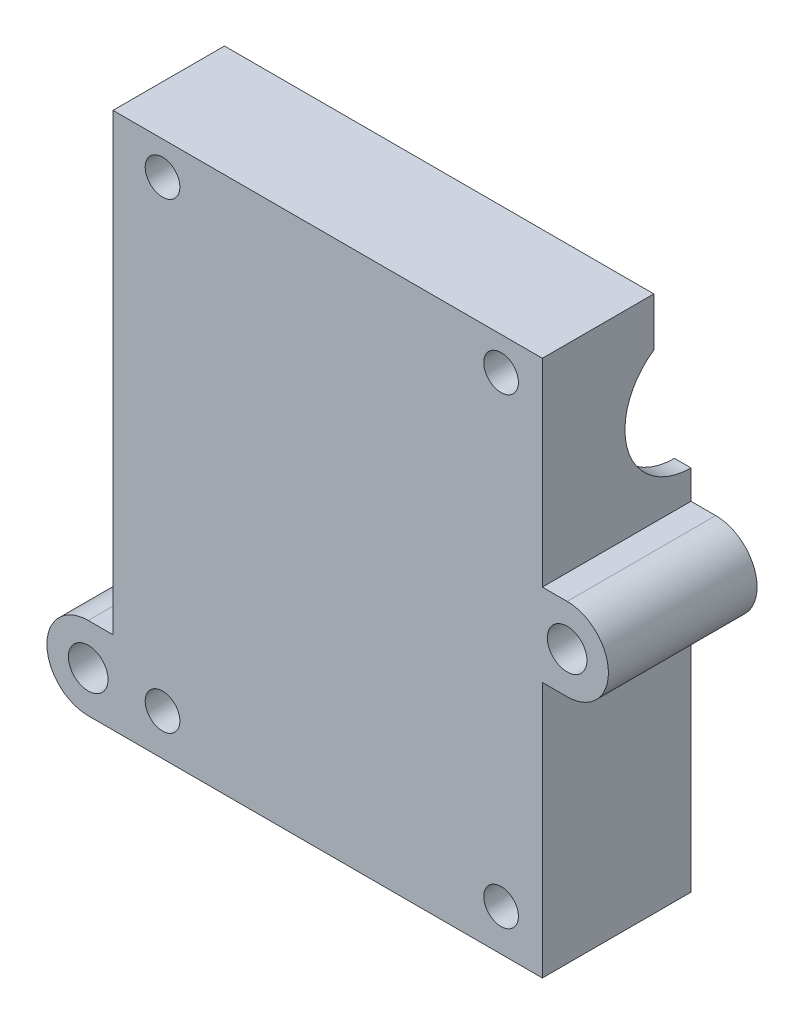
ISO-10303-21;
HEADER;
FILE_DESCRIPTION(('STEP AP214'),'2;1');
FILE_NAME('part.step','',(''),(''),'','','');
FILE_SCHEMA(('AUTOMOTIVE_DESIGN { 1 0 10303 214 1 1 1 1 }'));
ENDSEC;
DATA;
#1=APPLICATION_CONTEXT('core data for automotive mechanical design processes');
#2=APPLICATION_PROTOCOL_DEFINITION('international standard','automotive_design',2000,#1);
#3=PRODUCT_CONTEXT('',#1,'mechanical');
#4=PRODUCT('Part','Part','',(#3));
#5=PRODUCT_RELATED_PRODUCT_CATEGORY('part','',(#4));
#6=PRODUCT_DEFINITION_FORMATION('','',#4);
#7=PRODUCT_DEFINITION_CONTEXT('part definition',#1,'design');
#8=PRODUCT_DEFINITION('design','',#6,#7);
#9=PRODUCT_DEFINITION_SHAPE('','',#8);
#10=(LENGTH_UNIT() NAMED_UNIT(*) SI_UNIT(.MILLI.,.METRE.));
#11=(NAMED_UNIT(*) PLANE_ANGLE_UNIT() SI_UNIT($,.RADIAN.));
#12=(NAMED_UNIT(*) SI_UNIT($,.STERADIAN.) SOLID_ANGLE_UNIT());
#13=UNCERTAINTY_MEASURE_WITH_UNIT(LENGTH_MEASURE(1.E-05),#10,'distance_accuracy_value','');
#14=(GEOMETRIC_REPRESENTATION_CONTEXT(3) GLOBAL_UNCERTAINTY_ASSIGNED_CONTEXT((#13)) GLOBAL_UNIT_ASSIGNED_CONTEXT((#10,
#11,#12)) REPRESENTATION_CONTEXT('',''));
#15=CARTESIAN_POINT('',(0.,0.,0.));
#16=DIRECTION('',(0.,0.,1.));
#17=DIRECTION('',(1.,0.,0.));
#18=AXIS2_PLACEMENT_3D('',#15,#16,#17);
#19=CARTESIAN_POINT('',(0.,0.,-4.28190217244368));
#20=DIRECTION('',(0.,0.,-1.));
#21=DIRECTION('',(-1.,0.,0.));
#22=AXIS2_PLACEMENT_3D('',#19,#20,#21);
#23=PLANE('',#22);
#24=DIRECTION('',(0.,1.,0.));
#25=VECTOR('',#24,1.);
#26=CARTESIAN_POINT('',(12.0219936311464,4.85615145466885,-4.28190217244368));
#27=LINE('',#26,#25);
#28=CARTESIAN_POINT('',(12.0219936311464,-25.1438485453311,-4.28190217244367));
#29=VERTEX_POINT('',#28);
#30=CARTESIAN_POINT('',(12.0219936311464,9.35615145466886,-4.28190217244367));
#31=VERTEX_POINT('',#30);
#32=EDGE_CURVE('E236',#29,#31,#27,.T.);
#33=ORIENTED_EDGE('',*,*,#32,.T.);
#34=DIRECTION('',(-1.,0.,0.));
#35=VECTOR('',#34,1.);
#36=CARTESIAN_POINT('',(64.0219936311464,9.35615145466886,-4.28190217244367));
#37=LINE('',#36,#35);
#38=CARTESIAN_POINT('',(14.9219936311464,9.35615145466886,-4.28190217244367));
#39=VERTEX_POINT('',#38);
#40=EDGE_CURVE('E232',#31,#39,#37,.F.);
#41=ORIENTED_EDGE('',*,*,#40,.T.);
#42=DIRECTION('',(0.,-1.,0.));
#43=VECTOR('',#42,1.);
#44=CARTESIAN_POINT('',(14.9219936311464,35.8561514546689,-4.28190217244368));
#45=LINE('',#44,#43);
#46=CARTESIAN_POINT('',(14.9219936311464,-35.1438485453311,-4.28190217244367));
#47=VERTEX_POINT('',#46);
#48=EDGE_CURVE('E317',#39,#47,#45,.T.);
#49=ORIENTED_EDGE('',*,*,#48,.T.);
#50=DIRECTION('',(1.,0.,0.));
#51=VECTOR('',#50,1.);
#52=CARTESIAN_POINT('',(0.,-35.1438485453311,-4.28190217244368));
#53=LINE('',#52,#51);
#54=CARTESIAN_POINT('',(9.02199363114642,-35.1438485453311,-4.28190217244367));
#55=VERTEX_POINT('',#54);
#56=EDGE_CURVE('E225',#55,#47,#53,.T.);
#57=ORIENTED_EDGE('',*,*,#56,.F.);
#58=CARTESIAN_POINT('',(9.02199363114642,-30.1438485453311,-4.28190217244367));
#59=DIRECTION('',(0.,0.,-1.));
#60=DIRECTION('',(-1.,0.,0.));
#61=AXIS2_PLACEMENT_3D('',#58,#59,#60);
#62=CIRCLE('',#61,5.);
#63=CARTESIAN_POINT('',(9.02199363114642,-25.1438485453311,-4.28190217244367));
#64=VERTEX_POINT('',#63);
#65=EDGE_CURVE('E310',#64,#55,#62,.F.);
#66=ORIENTED_EDGE('',*,*,#65,.F.);
#67=DIRECTION('',(-1.,0.,0.));
#68=VECTOR('',#67,1.);
#69=CARTESIAN_POINT('',(12.0219936311464,-25.1438485453311,-4.28190217244367));
#70=LINE('',#69,#68);
#71=EDGE_CURVE('E308',#29,#64,#70,.T.);
#72=ORIENTED_EDGE('',*,*,#71,.F.);
#73=EDGE_LOOP('',(#33,#41,#49,#57,#66,#72));
#74=FACE_BOUND('',#73,.T.);
#75=CARTESIAN_POINT('',(9.02199363114642,-30.1438485453311,-4.28190217244367));
#76=DIRECTION('',(0.,0.,-1.));
#77=DIRECTION('',(-1.,0.,0.));
#78=AXIS2_PLACEMENT_3D('',#75,#76,#77);
#79=CIRCLE('',#78,2.4);
#80=CARTESIAN_POINT('',(6.62199363114642,-30.1438485453311,-4.28190217244367));
#81=VERTEX_POINT('',#80);
#82=EDGE_CURVE('E233',#81,#81,#79,.F.);
#83=ORIENTED_EDGE('',*,*,#82,.T.);
#84=EDGE_LOOP('',(#83));
#85=FACE_BOUND('',#84,.T.);
#86=ADVANCED_FACE('F33',(#74,#85),#23,.T.);
#87=CARTESIAN_POINT('',(67.0219936311464,0.856151454668876,-4.28190217244367));
#88=DIRECTION('',(0.,0.,-1.));
#89=DIRECTION('',(-1.,0.,0.));
#90=AXIS2_PLACEMENT_3D('',#87,#88,#89);
#91=CIRCLE('',#90,2.4);
#92=CARTESIAN_POINT('',(64.6219936311464,0.856151454668876,-4.28190217244367));
#93=VERTEX_POINT('',#92);
#94=EDGE_CURVE('E239',#93,#93,#91,.F.);
#95=ORIENTED_EDGE('',*,*,#94,.T.);
#96=EDGE_LOOP('',(#95));
#97=FACE_BOUND('',#96,.T.);
#98=CARTESIAN_POINT('',(62.0219936311464,-35.1438485453311,-4.28190217244368));
#99=VERTEX_POINT('',#98);
#100=CARTESIAN_POINT('',(64.0219936311464,-35.1438485453311,-4.28190217244367));
#101=VERTEX_POINT('',#100);
#102=EDGE_CURVE('E312',#99,#101,#53,.T.);
#103=ORIENTED_EDGE('',*,*,#102,.F.);
#104=DIRECTION('',(0.,1.,0.));
#105=VECTOR('',#104,1.);
#106=CARTESIAN_POINT('',(62.0219936311464,35.8561514546689,-4.28190217244367));
#107=LINE('',#106,#105);
#108=CARTESIAN_POINT('',(62.0219936311464,9.35615145466886,-4.28190217244367));
#109=VERTEX_POINT('',#108);
#110=EDGE_CURVE('E231',#99,#109,#107,.T.);
#111=ORIENTED_EDGE('',*,*,#110,.T.);
#112=DIRECTION('',(-1.,0.,0.));
#113=VECTOR('',#112,1.);
#114=CARTESIAN_POINT('',(64.0219936311464,9.35615145466886,-4.28190217244367));
#115=LINE('',#114,#113);
#116=CARTESIAN_POINT('',(64.0219936311464,9.35615145466886,-4.28190217244367));
#117=VERTEX_POINT('',#116);
#118=EDGE_CURVE('E212',#109,#117,#115,.F.);
#119=ORIENTED_EDGE('',*,*,#118,.T.);
#120=DIRECTION('',(0.,1.,0.));
#121=VECTOR('',#120,1.);
#122=CARTESIAN_POINT('',(64.0219936311464,29.8561514546689,-4.28190217244367));
#123=LINE('',#122,#121);
#124=CARTESIAN_POINT('',(64.0219936311464,5.85615145466888,-4.28190217244367));
#125=VERTEX_POINT('',#124);
#126=EDGE_CURVE('E221',#125,#117,#123,.T.);
#127=ORIENTED_EDGE('',*,*,#126,.F.);
#128=DIRECTION('',(-1.,0.,0.));
#129=VECTOR('',#128,1.);
#130=CARTESIAN_POINT('',(64.0219936311464,5.85615145466888,-4.28190217244367));
#131=LINE('',#130,#129);
#132=CARTESIAN_POINT('',(67.0219936311464,5.85615145466888,-4.28190217244367));
#133=VERTEX_POINT('',#132);
#134=EDGE_CURVE('E302',#133,#125,#131,.T.);
#135=ORIENTED_EDGE('',*,*,#134,.F.);
#136=CARTESIAN_POINT('',(67.0219936311464,0.856151454668876,-4.28190217244367));
#137=DIRECTION('',(0.,0.,-1.));
#138=DIRECTION('',(-1.,0.,0.));
#139=AXIS2_PLACEMENT_3D('',#136,#137,#138);
#140=CIRCLE('',#139,5.);
#141=CARTESIAN_POINT('',(67.0219936311464,-4.14384854533112,-4.28190217244367));
#142=VERTEX_POINT('',#141);
#143=EDGE_CURVE('E306',#142,#133,#140,.F.);
#144=ORIENTED_EDGE('',*,*,#143,.F.);
#145=DIRECTION('',(1.,0.,0.));
#146=VECTOR('',#145,1.);
#147=CARTESIAN_POINT('',(64.0219936311464,-4.14384854533112,-4.28190217244367));
#148=LINE('',#147,#146);
#149=CARTESIAN_POINT('',(64.0219936311464,-4.14384854533112,-4.28190217244367));
#150=VERTEX_POINT('',#149);
#151=EDGE_CURVE('E286',#150,#142,#148,.T.);
#152=ORIENTED_EDGE('',*,*,#151,.F.);
#153=DIRECTION('',(0.,1.,0.));
#154=VECTOR('',#153,1.);
#155=CARTESIAN_POINT('',(64.0219936311464,29.8561514546689,-4.28190217244367));
#156=LINE('',#155,#154);
#157=EDGE_CURVE('E226',#101,#150,#156,.T.);
#158=ORIENTED_EDGE('',*,*,#157,.F.);
#159=EDGE_LOOP('',(#103,#111,#119,#127,#135,#144,#152,#158));
#160=FACE_BOUND('',#159,.T.);
#161=ADVANCED_FACE('F229',(#97,#160),#23,.T.);
#162=CARTESIAN_POINT('',(64.0219936311464,29.8561514546689,-17.2819021724437));
#163=DIRECTION('',(1.,0.,0.));
#164=DIRECTION('',(0.,0.,-1.));
#165=AXIS2_PLACEMENT_3D('',#162,#163,#164);
#166=PLANE('',#165);
#167=DIRECTION('',(0.,0.,1.));
#168=VECTOR('',#167,1.);
#169=CARTESIAN_POINT('',(64.0219936311464,-35.1438485453311,-22.2819021724437));
#170=LINE('',#169,#168);
#171=CARTESIAN_POINT('',(64.0219936311464,-35.1438485453311,13.7180978275563));
#172=VERTEX_POINT('',#171);
#173=EDGE_CURVE('E259',#101,#172,#170,.T.);
#174=ORIENTED_EDGE('',*,*,#173,.F.);
#175=ORIENTED_EDGE('',*,*,#157,.T.);
#176=DIRECTION('',(0.,0.,1.));
#177=VECTOR('',#176,1.);
#178=CARTESIAN_POINT('',(64.0219936311464,-4.14384854533112,-40.0881506473094));
#179=LINE('',#178,#177);
#180=CARTESIAN_POINT('',(64.0219936311464,-4.14384854533112,13.7180978275563));
#181=VERTEX_POINT('',#180);
#182=EDGE_CURVE('E277',#150,#181,#179,.T.);
#183=ORIENTED_EDGE('',*,*,#182,.T.);
#184=DIRECTION('',(0.,1.,0.));
#185=VECTOR('',#184,1.);
#186=CARTESIAN_POINT('',(64.0219936311464,4.85615145466886,13.7180978275563));
#187=LINE('',#186,#185);
#188=EDGE_CURVE('E298',#172,#181,#187,.T.);
#189=ORIENTED_EDGE('',*,*,#188,.F.);
#190=EDGE_LOOP('',(#174,#175,#183,#189));
#191=FACE_BOUND('',#190,.T.);
#192=ADVANCED_FACE('F378',(#191),#166,.T.);
#193=CARTESIAN_POINT('',(62.0219936311464,35.8561514546689,-14.7819021724437));
#194=DIRECTION('',(1.,0.,0.));
#195=DIRECTION('',(0.,1.,0.));
#196=AXIS2_PLACEMENT_3D('',#193,#194,#195);
#197=PLANE('',#196);
#198=ORIENTED_EDGE('',*,*,#110,.F.);
#199=DIRECTION('',(0.,0.,1.));
#200=VECTOR('',#199,1.);
#201=CARTESIAN_POINT('',(62.0219936311464,-35.1438485453311,-14.7819021724437));
#202=LINE('',#201,#200);
#203=CARTESIAN_POINT('',(62.0219936311464,-35.1438485453311,6.21809782755633));
#204=VERTEX_POINT('',#203);
#205=EDGE_CURVE('E263',#99,#204,#202,.T.);
#206=ORIENTED_EDGE('',*,*,#205,.T.);
#207=DIRECTION('',(0.,-1.,0.));
#208=VECTOR('',#207,1.);
#209=CARTESIAN_POINT('',(62.0219936311464,35.8561514546689,6.21809782755633));
#210=LINE('',#209,#208);
#211=CARTESIAN_POINT('',(62.0219936311464,15.9848707168199,6.21809782755633));
#212=VERTEX_POINT('',#211);
#213=EDGE_CURVE('E431',#212,#204,#210,.T.);
#214=ORIENTED_EDGE('',*,*,#213,.F.);
#215=CARTESIAN_POINT('',(62.0219936311464,12.7061514546689,-4.28190217244367));
#216=DIRECTION('',(1.,0.,0.));
#217=DIRECTION('',(0.,1.,0.));
#218=AXIS2_PLACEMENT_3D('',#215,#216,#217);
#219=CIRCLE('',#218,11.);
#220=CARTESIAN_POINT('',(62.0219936311464,21.1601837127334,2.75580616050141));
#221=VERTEX_POINT('',#220);
#222=EDGE_CURVE('E462',#212,#221,#219,.F.);
#223=ORIENTED_EDGE('',*,*,#222,.T.);
#224=CARTESIAN_POINT('',(62.0219936311464,17.3561514546689,-4.28190217244367));
#225=DIRECTION('',(1.,0.,0.));
#226=DIRECTION('',(0.,1.,0.));
#227=AXIS2_PLACEMENT_3D('',#224,#225,#226);
#228=CIRCLE('',#227,8.);
#229=EDGE_CURVE('E252',#221,#109,#228,.T.);
#230=ORIENTED_EDGE('',*,*,#229,.T.);
#231=EDGE_LOOP('',(#198,#206,#214,#223,#230));
#232=FACE_BOUND('',#231,.T.);
#233=ADVANCED_FACE('F380',(#232),#197,.F.);
#234=CARTESIAN_POINT('',(14.9219936311464,35.8561514546689,-12.7819021724437));
#235=DIRECTION('',(-1.,0.,0.));
#236=DIRECTION('',(0.,-1.,0.));
#237=AXIS2_PLACEMENT_3D('',#234,#235,#236);
#238=PLANE('',#237);
#239=ORIENTED_EDGE('',*,*,#48,.F.);
#240=CARTESIAN_POINT('',(14.9219936311464,17.3561514546689,-4.28190217244367));
#241=DIRECTION('',(-1.,0.,0.));
#242=DIRECTION('',(0.,-1.,0.));
#243=AXIS2_PLACEMENT_3D('',#240,#241,#242);
#244=CIRCLE('',#243,8.);
#245=CARTESIAN_POINT('',(14.9219936311464,21.1601837127334,2.7558061605014));
#246=VERTEX_POINT('',#245);
#247=EDGE_CURVE('E254',#39,#246,#244,.T.);
#248=ORIENTED_EDGE('',*,*,#247,.T.);
#249=CARTESIAN_POINT('',(14.9219936311464,12.7061514546689,-4.28190217244368));
#250=DIRECTION('',(-1.,0.,0.));
#251=DIRECTION('',(0.,1.,0.));
#252=AXIS2_PLACEMENT_3D('',#249,#250,#251);
#253=CIRCLE('',#252,11.);
#254=CARTESIAN_POINT('',(14.9219936311464,19.6882714765533,4.21809782755633));
#255=VERTEX_POINT('',#254);
#256=EDGE_CURVE('E460',#255,#246,#253,.T.);
#257=ORIENTED_EDGE('',*,*,#256,.F.);
#258=DIRECTION('',(0.,-1.,0.));
#259=VECTOR('',#258,1.);
#260=CARTESIAN_POINT('',(14.9219936311464,35.8561514546689,4.21809782755633));
#261=LINE('',#260,#259);
#262=CARTESIAN_POINT('',(14.9219936311464,-35.1438485453311,4.21809782755633));
#263=VERTEX_POINT('',#262);
#264=EDGE_CURVE('E436',#255,#263,#261,.T.);
#265=ORIENTED_EDGE('',*,*,#264,.T.);
#266=DIRECTION('',(0.,0.,-1.));
#267=VECTOR('',#266,1.);
#268=CARTESIAN_POINT('',(14.9219936311464,-35.1438485453311,4.21809782755633));
#269=LINE('',#268,#267);
#270=EDGE_CURVE('E265',#263,#47,#269,.T.);
#271=ORIENTED_EDGE('',*,*,#270,.T.);
#272=EDGE_LOOP('',(#239,#248,#257,#265,#271));
#273=FACE_BOUND('',#272,.T.);
#274=ADVANCED_FACE('F332',(#273),#238,.F.);
#275=DIRECTION('',(0.,0.,1.));
#276=VECTOR('',#275,1.);
#277=CARTESIAN_POINT('',(64.0219936311464,5.85615145466888,-40.0881506473094));
#278=LINE('',#277,#276);
#279=CARTESIAN_POINT('',(64.0219936311464,5.85615145466888,13.7180978275563));
#280=VERTEX_POINT('',#279);
#281=EDGE_CURVE('E59',#125,#280,#278,.T.);
#282=ORIENTED_EDGE('',*,*,#281,.F.);
#283=ORIENTED_EDGE('',*,*,#126,.T.);
#284=CARTESIAN_POINT('',(64.0219936311464,17.3561514546689,-4.28190217244367));
#285=DIRECTION('',(-1.,0.,0.));
#286=DIRECTION('',(0.,0.,1.));
#287=AXIS2_PLACEMENT_3D('',#284,#285,#286);
#288=CIRCLE('',#287,8.);
#289=CARTESIAN_POINT('',(64.0219936311464,23.9705297323303,0.218097827556323));
#290=VERTEX_POINT('',#289);
#291=EDGE_CURVE('E207',#117,#290,#288,.T.);
#292=ORIENTED_EDGE('',*,*,#291,.T.);
#293=DIRECTION('',(0.,1.,0.));
#294=VECTOR('',#293,1.);
#295=CARTESIAN_POINT('',(64.0219936311464,22.8561514546689,0.218097827556323));
#296=LINE('',#295,#294);
#297=CARTESIAN_POINT('',(64.0219936311464,29.8561514546689,0.218097827556323));
#298=VERTEX_POINT('',#297);
#299=EDGE_CURVE('E481',#290,#298,#296,.T.);
#300=ORIENTED_EDGE('',*,*,#299,.T.);
#301=DIRECTION('',(0.,0.,-1.));
#302=VECTOR('',#301,1.);
#303=CARTESIAN_POINT('',(64.0219936311464,29.8561514546689,-17.2819021724437));
#304=LINE('',#303,#302);
#305=CARTESIAN_POINT('',(64.0219936311464,29.8561514546689,13.7180978275563));
#306=VERTEX_POINT('',#305);
#307=EDGE_CURVE('E245',#306,#298,#304,.T.);
#308=ORIENTED_EDGE('',*,*,#307,.F.);
#309=EDGE_CURVE('E430',#280,#306,#187,.T.);
#310=ORIENTED_EDGE('',*,*,#309,.F.);
#311=EDGE_LOOP('',(#282,#283,#292,#300,#308,#310));
#312=FACE_BOUND('',#311,.T.);
#313=ADVANCED_FACE('F222',(#312),#166,.T.);
#314=CARTESIAN_POINT('',(12.0219936311464,4.85615145466885,13.7180978275563));
#315=DIRECTION('',(1.,0.,0.));
#316=DIRECTION('',(0.,0.,-1.));
#317=AXIS2_PLACEMENT_3D('',#314,#315,#316);
#318=PLANE('',#317);
#319=ORIENTED_EDGE('',*,*,#32,.F.);
#320=DIRECTION('',(0.,0.,1.));
#321=VECTOR('',#320,1.);
#322=CARTESIAN_POINT('',(12.0219936311464,-25.1438485453311,-40.0881506473094));
#323=LINE('',#322,#321);
#324=CARTESIAN_POINT('',(12.0219936311464,-25.1438485453311,13.7180978275563));
#325=VERTEX_POINT('',#324);
#326=EDGE_CURVE('E79',#29,#325,#323,.T.);
#327=ORIENTED_EDGE('',*,*,#326,.T.);
#328=DIRECTION('',(0.,-1.,0.));
#329=VECTOR('',#328,1.);
#330=CARTESIAN_POINT('',(12.0219936311464,4.85615145466885,13.7180978275563));
#331=LINE('',#330,#329);
#332=CARTESIAN_POINT('',(12.0219936311464,29.8561514546689,13.7180978275563));
#333=VERTEX_POINT('',#332);
#334=EDGE_CURVE('E251',#333,#325,#331,.T.);
#335=ORIENTED_EDGE('',*,*,#334,.F.);
#336=DIRECTION('',(0.,0.,-1.));
#337=VECTOR('',#336,1.);
#338=CARTESIAN_POINT('',(12.0219936311464,29.8561514546689,13.7180978275563));
#339=LINE('',#338,#337);
#340=CARTESIAN_POINT('',(12.0219936311464,29.8561514546689,0.218097827556329));
#341=VERTEX_POINT('',#340);
#342=EDGE_CURVE('E247',#333,#341,#339,.T.);
#343=ORIENTED_EDGE('',*,*,#342,.T.);
#344=DIRECTION('',(0.,1.,0.));
#345=VECTOR('',#344,1.);
#346=CARTESIAN_POINT('',(12.0219936311464,22.8561514546689,0.218097827556329));
#347=LINE('',#346,#345);
#348=CARTESIAN_POINT('',(12.0219936311464,23.9705297323303,0.218097827556329));
#349=VERTEX_POINT('',#348);
#350=EDGE_CURVE('E482',#349,#341,#347,.T.);
#351=ORIENTED_EDGE('',*,*,#350,.F.);
#352=CARTESIAN_POINT('',(12.0219936311464,17.3561514546689,-4.28190217244367));
#353=DIRECTION('',(-1.,0.,0.));
#354=DIRECTION('',(0.,0.,1.));
#355=AXIS2_PLACEMENT_3D('',#352,#353,#354);
#356=CIRCLE('',#355,8.);
#357=EDGE_CURVE('E217',#31,#349,#356,.T.);
#358=ORIENTED_EDGE('',*,*,#357,.F.);
#359=EDGE_LOOP('',(#319,#327,#335,#343,#351,#358));
#360=FACE_BOUND('',#359,.T.);
#361=ADVANCED_FACE('F396',(#360),#318,.F.);
#362=CARTESIAN_POINT('',(64.0219936311464,17.3561514546689,-4.28190217244367));
#363=DIRECTION('',(-1.,0.,0.));
#364=DIRECTION('',(0.,0.,1.));
#365=AXIS2_PLACEMENT_3D('',#362,#363,#364);
#366=CYLINDRICAL_SURFACE('',#365,8.);
#367=ORIENTED_EDGE('',*,*,#40,.F.);
#368=ORIENTED_EDGE('',*,*,#357,.T.);
#369=DIRECTION('',(-1.,0.,0.));
#370=VECTOR('',#369,1.);
#371=CARTESIAN_POINT('',(64.0219936311464,23.9705297323303,0.218097827556323));
#372=LINE('',#371,#370);
#373=CARTESIAN_POINT('',(14.9219936311464,23.9705297323303,0.218097827556323));
#374=VERTEX_POINT('',#373);
#375=EDGE_CURVE('E478',#349,#374,#372,.F.);
#376=ORIENTED_EDGE('',*,*,#375,.T.);
#377=EDGE_CURVE('E218',#246,#374,#244,.T.);
#378=ORIENTED_EDGE('',*,*,#377,.F.);
#379=ORIENTED_EDGE('',*,*,#247,.F.);
#380=EDGE_LOOP('',(#367,#368,#376,#378,#379));
#381=FACE_BOUND('',#380,.T.);
#382=ADVANCED_FACE('F35',(#381),#366,.F.);
#383=ORIENTED_EDGE('',*,*,#118,.F.);
#384=ORIENTED_EDGE('',*,*,#229,.F.);
#385=CARTESIAN_POINT('',(62.0219936311464,23.9705297323303,0.218097827556323));
#386=VERTEX_POINT('',#385);
#387=EDGE_CURVE('E255',#386,#221,#228,.T.);
#388=ORIENTED_EDGE('',*,*,#387,.F.);
#389=DIRECTION('',(-1.,0.,0.));
#390=VECTOR('',#389,1.);
#391=CARTESIAN_POINT('',(64.0219936311464,23.9705297323303,0.218097827556323));
#392=LINE('',#391,#390);
#393=EDGE_CURVE('E215',#386,#290,#392,.F.);
#394=ORIENTED_EDGE('',*,*,#393,.T.);
#395=ORIENTED_EDGE('',*,*,#291,.F.);
#396=EDGE_LOOP('',(#383,#384,#388,#394,#395));
#397=FACE_BOUND('',#396,.T.);
#398=ADVANCED_FACE('F209',(#397),#366,.F.);
#399=CARTESIAN_POINT('',(0.,-35.1438485453311,0.));
#400=DIRECTION('',(0.,-1.,0.));
#401=DIRECTION('',(1.,0.,0.));
#402=AXIS2_PLACEMENT_3D('',#399,#400,#401);
#403=PLANE('',#402);
#404=DIRECTION('',(0.,0.,1.));
#405=VECTOR('',#404,1.);
#406=CARTESIAN_POINT('',(9.02199363114642,-35.1438485453311,-40.0881506473094));
#407=LINE('',#406,#405);
#408=CARTESIAN_POINT('',(9.02199363114642,-35.1438485453311,13.7180978275563));
#409=VERTEX_POINT('',#408);
#410=EDGE_CURVE('E67',#55,#409,#407,.T.);
#411=ORIENTED_EDGE('',*,*,#410,.F.);
#412=ORIENTED_EDGE('',*,*,#56,.T.);
#413=ORIENTED_EDGE('',*,*,#270,.F.);
#414=DIRECTION('',(-1.,0.,0.));
#415=VECTOR('',#414,1.);
#416=CARTESIAN_POINT('',(23.9219936311464,-35.1438485453311,4.21809782755633));
#417=LINE('',#416,#415);
#418=CARTESIAN_POINT('',(23.9219936311464,-35.1438485453311,4.21809782755633));
#419=VERTEX_POINT('',#418);
#420=EDGE_CURVE('E269',#419,#263,#417,.T.);
#421=ORIENTED_EDGE('',*,*,#420,.F.);
#422=DIRECTION('',(0.,0.,-1.));
#423=VECTOR('',#422,1.);
#424=CARTESIAN_POINT('',(23.9219936311464,-35.1438485453311,6.71809782755633));
#425=LINE('',#424,#423);
#426=CARTESIAN_POINT('',(23.9219936311464,-35.1438485453311,6.71809782755633));
#427=VERTEX_POINT('',#426);
#428=EDGE_CURVE('E261',#427,#419,#425,.T.);
#429=ORIENTED_EDGE('',*,*,#428,.F.);
#430=DIRECTION('',(-1.,0.,0.));
#431=VECTOR('',#430,1.);
#432=CARTESIAN_POINT('',(51.9219936311464,-35.1438485453311,6.71809782755633));
#433=LINE('',#432,#431);
#434=CARTESIAN_POINT('',(51.9219936311464,-35.1438485453311,6.71809782755633));
#435=VERTEX_POINT('',#434);
#436=EDGE_CURVE('E468',#435,#427,#433,.T.);
#437=ORIENTED_EDGE('',*,*,#436,.F.);
#438=DIRECTION('',(0.,0.,1.));
#439=VECTOR('',#438,1.);
#440=CARTESIAN_POINT('',(51.9219936311464,-35.1438485453311,6.21809782755632));
#441=LINE('',#440,#439);
#442=CARTESIAN_POINT('',(51.9219936311464,-35.1438485453311,6.21809782755632));
#443=VERTEX_POINT('',#442);
#444=EDGE_CURVE('E471',#443,#435,#441,.T.);
#445=ORIENTED_EDGE('',*,*,#444,.F.);
#446=DIRECTION('',(-1.,0.,0.));
#447=VECTOR('',#446,1.);
#448=CARTESIAN_POINT('',(62.0219936311464,-35.1438485453311,6.21809782755633));
#449=LINE('',#448,#447);
#450=EDGE_CURVE('E266',#204,#443,#449,.T.);
#451=ORIENTED_EDGE('',*,*,#450,.F.);
#452=ORIENTED_EDGE('',*,*,#205,.F.);
#453=ORIENTED_EDGE('',*,*,#102,.T.);
#454=ORIENTED_EDGE('',*,*,#173,.T.);
#455=DIRECTION('',(-1.,0.,0.));
#456=VECTOR('',#455,1.);
#457=CARTESIAN_POINT('',(64.0219936311464,-35.1438485453311,13.7180978275563));
#458=LINE('',#457,#456);
#459=EDGE_CURVE('E262',#172,#409,#458,.T.);
#460=ORIENTED_EDGE('',*,*,#459,.T.);
#461=EDGE_LOOP('',(#411,#412,#413,#421,#429,#437,#445,#451,#452,#453,#454,#460));
#462=FACE_BOUND('',#461,.T.);
#463=ADVANCED_FACE('F337',(#462),#403,.T.);
#464=CARTESIAN_POINT('',(9.02199363114642,-30.1438485453311,-40.0881506473094));
#465=DIRECTION('',(0.,0.,1.));
#466=DIRECTION('',(1.,0.,0.));
#467=AXIS2_PLACEMENT_3D('',#464,#465,#466);
#468=CYLINDRICAL_SURFACE('',#467,5.);
#469=DIRECTION('',(0.,0.,1.));
#470=VECTOR('',#469,1.);
#471=CARTESIAN_POINT('',(9.02199363114642,-25.1438485453311,-40.0881506473094));
#472=LINE('',#471,#470);
#473=CARTESIAN_POINT('',(9.02199363114642,-25.1438485453311,13.7180978275563));
#474=VERTEX_POINT('',#473);
#475=EDGE_CURVE('E271',#64,#474,#472,.T.);
#476=ORIENTED_EDGE('',*,*,#475,.F.);
#477=ORIENTED_EDGE('',*,*,#65,.T.);
#478=ORIENTED_EDGE('',*,*,#410,.T.);
#479=CARTESIAN_POINT('',(9.02199363114642,-30.1438485453311,13.7180978275563));
#480=DIRECTION('',(0.,0.,1.));
#481=DIRECTION('',(1.,0.,0.));
#482=AXIS2_PLACEMENT_3D('',#479,#480,#481);
#483=CIRCLE('',#482,5.);
#484=EDGE_CURVE('E343',#474,#409,#483,.T.);
#485=ORIENTED_EDGE('',*,*,#484,.F.);
#486=EDGE_LOOP('',(#476,#477,#478,#485));
#487=FACE_BOUND('',#486,.T.);
#488=ADVANCED_FACE('F414',(#487),#468,.T.);
#489=CARTESIAN_POINT('',(12.0219936311464,-25.1438485453311,-40.0881506473094));
#490=DIRECTION('',(0.,1.,0.));
#491=DIRECTION('',(0.,0.,1.));
#492=AXIS2_PLACEMENT_3D('',#489,#490,#491);
#493=PLANE('',#492);
#494=ORIENTED_EDGE('',*,*,#326,.F.);
#495=ORIENTED_EDGE('',*,*,#71,.T.);
#496=ORIENTED_EDGE('',*,*,#475,.T.);
#497=DIRECTION('',(-1.,0.,0.));
#498=VECTOR('',#497,1.);
#499=CARTESIAN_POINT('',(12.0219936311464,-25.1438485453311,13.7180978275563));
#500=LINE('',#499,#498);
#501=EDGE_CURVE('E345',#325,#474,#500,.T.);
#502=ORIENTED_EDGE('',*,*,#501,.F.);
#503=EDGE_LOOP('',(#494,#495,#496,#502));
#504=FACE_BOUND('',#503,.T.);
#505=ADVANCED_FACE('F416',(#504),#493,.T.);
#506=CARTESIAN_POINT('',(9.02199363114642,-30.1438485453311,-40.0881506473094));
#507=DIRECTION('',(0.,0.,1.));
#508=DIRECTION('',(1.,0.,0.));
#509=AXIS2_PLACEMENT_3D('',#506,#507,#508);
#510=CYLINDRICAL_SURFACE('',#509,2.4);
#511=CARTESIAN_POINT('',(9.02199363114642,-30.1438485453311,13.7180978275563));
#512=DIRECTION('',(0.,0.,1.));
#513=DIRECTION('',(1.,0.,0.));
#514=AXIS2_PLACEMENT_3D('',#511,#512,#513);
#515=CIRCLE('',#514,2.4);
#516=CARTESIAN_POINT('',(11.4219936311464,-30.1438485453311,13.7180978275563));
#517=VERTEX_POINT('',#516);
#518=EDGE_CURVE('E272',#517,#517,#515,.T.);
#519=ORIENTED_EDGE('',*,*,#518,.T.);
#520=EDGE_LOOP('',(#519));
#521=FACE_BOUND('',#520,.T.);
#522=ORIENTED_EDGE('',*,*,#82,.F.);
#523=EDGE_LOOP('',(#522));
#524=FACE_BOUND('',#523,.T.);
#525=ADVANCED_FACE('F420',(#521,#524),#510,.F.);
#526=CARTESIAN_POINT('',(67.0219936311464,0.856151454668876,-40.0881506473094));
#527=DIRECTION('',(0.,0.,1.));
#528=DIRECTION('',(1.,0.,0.));
#529=AXIS2_PLACEMENT_3D('',#526,#527,#528);
#530=CYLINDRICAL_SURFACE('',#529,5.);
#531=DIRECTION('',(0.,0.,1.));
#532=VECTOR('',#531,1.);
#533=CARTESIAN_POINT('',(67.0219936311464,-4.14384854533112,-40.0881506473094));
#534=LINE('',#533,#532);
#535=CARTESIAN_POINT('',(67.0219936311464,-4.14384854533112,13.7180978275563));
#536=VERTEX_POINT('',#535);
#537=EDGE_CURVE('E42',#142,#536,#534,.T.);
#538=ORIENTED_EDGE('',*,*,#537,.F.);
#539=ORIENTED_EDGE('',*,*,#143,.T.);
#540=DIRECTION('',(0.,0.,1.));
#541=VECTOR('',#540,1.);
#542=CARTESIAN_POINT('',(67.0219936311464,5.85615145466888,-40.0881506473094));
#543=LINE('',#542,#541);
#544=CARTESIAN_POINT('',(67.0219936311464,5.85615145466888,13.7180978275563));
#545=VERTEX_POINT('',#544);
#546=EDGE_CURVE('E11',#133,#545,#543,.T.);
#547=ORIENTED_EDGE('',*,*,#546,.T.);
#548=CARTESIAN_POINT('',(67.0219936311464,0.856151454668876,13.7180978275563));
#549=DIRECTION('',(0.,0.,1.));
#550=DIRECTION('',(1.,0.,0.));
#551=AXIS2_PLACEMENT_3D('',#548,#549,#550);
#552=CIRCLE('',#551,5.);
#553=EDGE_CURVE('E289',#536,#545,#552,.T.);
#554=ORIENTED_EDGE('',*,*,#553,.F.);
#555=EDGE_LOOP('',(#538,#539,#547,#554));
#556=FACE_BOUND('',#555,.T.);
#557=ADVANCED_FACE('F290',(#556),#530,.T.);
#558=CARTESIAN_POINT('',(64.0219936311464,-4.14384854533112,-40.0881506473094));
#559=DIRECTION('',(0.,-1.,0.));
#560=DIRECTION('',(0.,0.,-1.));
#561=AXIS2_PLACEMENT_3D('',#558,#559,#560);
#562=PLANE('',#561);
#563=ORIENTED_EDGE('',*,*,#182,.F.);
#564=ORIENTED_EDGE('',*,*,#151,.T.);
#565=ORIENTED_EDGE('',*,*,#537,.T.);
#566=DIRECTION('',(1.,0.,0.));
#567=VECTOR('',#566,1.);
#568=CARTESIAN_POINT('',(64.0219936311464,-4.14384854533112,13.7180978275563));
#569=LINE('',#568,#567);
#570=EDGE_CURVE('E275',#181,#536,#569,.T.);
#571=ORIENTED_EDGE('',*,*,#570,.F.);
#572=EDGE_LOOP('',(#563,#564,#565,#571));
#573=FACE_BOUND('',#572,.T.);
#574=ADVANCED_FACE('F283',(#573),#562,.T.);
#575=CARTESIAN_POINT('',(64.0219936311464,5.85615145466888,-40.0881506473094));
#576=DIRECTION('',(0.,1.,0.));
#577=DIRECTION('',(0.,0.,1.));
#578=AXIS2_PLACEMENT_3D('',#575,#576,#577);
#579=PLANE('',#578);
#580=ORIENTED_EDGE('',*,*,#546,.F.);
#581=ORIENTED_EDGE('',*,*,#134,.T.);
#582=ORIENTED_EDGE('',*,*,#281,.T.);
#583=DIRECTION('',(-1.,0.,0.));
#584=VECTOR('',#583,1.);
#585=CARTESIAN_POINT('',(64.0219936311464,5.85615145466888,13.7180978275563));
#586=LINE('',#585,#584);
#587=EDGE_CURVE('E292',#545,#280,#586,.T.);
#588=ORIENTED_EDGE('',*,*,#587,.F.);
#589=EDGE_LOOP('',(#580,#581,#582,#588));
#590=FACE_BOUND('',#589,.T.);
#591=ADVANCED_FACE('F576',(#590),#579,.T.);
#592=CARTESIAN_POINT('',(67.0219936311464,0.856151454668876,-40.0881506473094));
#593=DIRECTION('',(0.,0.,1.));
#594=DIRECTION('',(1.,0.,0.));
#595=AXIS2_PLACEMENT_3D('',#592,#593,#594);
#596=CYLINDRICAL_SURFACE('',#595,2.4);
#597=CARTESIAN_POINT('',(67.0219936311464,0.856151454668876,13.7180978275563));
#598=DIRECTION('',(0.,0.,1.));
#599=DIRECTION('',(1.,0.,0.));
#600=AXIS2_PLACEMENT_3D('',#597,#598,#599);
#601=CIRCLE('',#600,2.4);
#602=CARTESIAN_POINT('',(69.4219936311464,0.856151454668876,13.7180978275563));
#603=VERTEX_POINT('',#602);
#604=EDGE_CURVE('E278',#603,#603,#601,.T.);
#605=ORIENTED_EDGE('',*,*,#604,.T.);
#606=EDGE_LOOP('',(#605));
#607=FACE_BOUND('',#606,.T.);
#608=ORIENTED_EDGE('',*,*,#94,.F.);
#609=EDGE_LOOP('',(#608));
#610=FACE_BOUND('',#609,.T.);
#611=ADVANCED_FACE('F356',(#607,#610),#596,.F.);
#612=CARTESIAN_POINT('',(0.521993631146425,29.8561514546689,-17.2819021724437));
#613=DIRECTION('',(0.,1.,0.));
#614=DIRECTION('',(-1.,0.,0.));
#615=AXIS2_PLACEMENT_3D('',#612,#613,#614);
#616=PLANE('',#615);
#617=DIRECTION('',(-1.,0.,0.));
#618=VECTOR('',#617,1.);
#619=CARTESIAN_POINT('',(80.3624543669077,29.8561514546689,0.218097827556328));
#620=LINE('',#619,#618);
#621=EDGE_CURVE('E87',#298,#341,#620,.T.);
#622=ORIENTED_EDGE('',*,*,#621,.T.);
#623=ORIENTED_EDGE('',*,*,#342,.F.);
#624=DIRECTION('',(-1.,0.,0.));
#625=VECTOR('',#624,1.);
#626=CARTESIAN_POINT('',(64.0219936311464,29.8561514546689,13.7180978275563));
#627=LINE('',#626,#625);
#628=EDGE_CURVE('E423',#306,#333,#627,.T.);
#629=ORIENTED_EDGE('',*,*,#628,.F.);
#630=ORIENTED_EDGE('',*,*,#307,.T.);
#631=EDGE_LOOP('',(#622,#623,#629,#630));
#632=FACE_BOUND('',#631,.T.);
#633=ADVANCED_FACE('F407',(#632),#616,.T.);
#634=CARTESIAN_POINT('',(14.9219936311464,35.8561514546689,4.21809782755633));
#635=DIRECTION('',(0.,0.,1.));
#636=DIRECTION('',(1.,0.,0.));
#637=AXIS2_PLACEMENT_3D('',#634,#635,#636);
#638=PLANE('',#637);
#639=CARTESIAN_POINT('',(18.0219936311464,-30.1438485453311,4.21809782755633));
#640=DIRECTION('',(0.,0.,1.));
#641=DIRECTION('',(1.,0.,0.));
#642=AXIS2_PLACEMENT_3D('',#639,#640,#641);
#643=CIRCLE('',#642,2.1);
#644=CARTESIAN_POINT('',(20.1219936311464,-30.1438485453311,4.21809782755633));
#645=VERTEX_POINT('',#644);
#646=EDGE_CURVE('E499',#645,#645,#643,.T.);
#647=ORIENTED_EDGE('',*,*,#646,.T.);
#648=EDGE_LOOP('',(#647));
#649=FACE_BOUND('',#648,.T.);
#650=DIRECTION('',(-1.,0.,0.));
#651=VECTOR('',#650,1.);
#652=CARTESIAN_POINT('',(80.3624543669077,19.6882714765533,4.21809782755633));
#653=LINE('',#652,#651);
#654=CARTESIAN_POINT('',(23.9219936311464,19.6882714765533,4.21809782755633));
#655=VERTEX_POINT('',#654);
#656=EDGE_CURVE('E440',#655,#255,#653,.T.);
#657=ORIENTED_EDGE('',*,*,#656,.F.);
#658=DIRECTION('',(0.,-1.,0.));
#659=VECTOR('',#658,1.);
#660=CARTESIAN_POINT('',(23.9219936311464,35.8561514546689,4.21809782755633));
#661=LINE('',#660,#659);
#662=EDGE_CURVE('E434',#655,#419,#661,.T.);
#663=ORIENTED_EDGE('',*,*,#662,.T.);
#664=ORIENTED_EDGE('',*,*,#420,.T.);
#665=ORIENTED_EDGE('',*,*,#264,.F.);
#666=EDGE_LOOP('',(#657,#663,#664,#665));
#667=FACE_BOUND('',#666,.T.);
#668=ADVANCED_FACE('F509',(#649,#667),#638,.F.);
#669=CARTESIAN_POINT('',(23.9219936311464,35.8561514546689,4.21809782755633));
#670=DIRECTION('',(-1.,0.,0.));
#671=DIRECTION('',(0.,-1.,0.));
#672=AXIS2_PLACEMENT_3D('',#669,#670,#671);
#673=PLANE('',#672);
#674=CARTESIAN_POINT('',(23.9219936311464,12.7061514546689,-4.28190217244367));
#675=DIRECTION('',(-1.,0.,0.));
#676=DIRECTION('',(0.,-1.,0.));
#677=AXIS2_PLACEMENT_3D('',#674,#675,#676);
#678=CIRCLE('',#677,11.);
#679=CARTESIAN_POINT('',(23.9219936311464,12.7061514546689,6.71809782755633));
#680=VERTEX_POINT('',#679);
#681=EDGE_CURVE('E444',#680,#655,#678,.T.);
#682=ORIENTED_EDGE('',*,*,#681,.F.);
#683=DIRECTION('',(0.,-1.,0.));
#684=VECTOR('',#683,1.);
#685=CARTESIAN_POINT('',(23.9219936311464,45.8561514546689,6.71809782755633));
#686=LINE('',#685,#684);
#687=EDGE_CURVE('E258',#680,#427,#686,.T.);
#688=ORIENTED_EDGE('',*,*,#687,.T.);
#689=ORIENTED_EDGE('',*,*,#428,.T.);
#690=ORIENTED_EDGE('',*,*,#662,.F.);
#691=EDGE_LOOP('',(#682,#688,#689,#690));
#692=FACE_BOUND('',#691,.T.);
#693=ADVANCED_FACE('F512',(#692),#673,.F.);
#694=CARTESIAN_POINT('',(23.9219936311464,35.8561514546689,6.21809782755632));
#695=DIRECTION('',(0.,0.,1.));
#696=DIRECTION('',(1.,0.,0.));
#697=AXIS2_PLACEMENT_3D('',#694,#695,#696);
#698=PLANE('',#697);
#699=CARTESIAN_POINT('',(59.0219936311464,-30.1438485453311,6.21809782755633));
#700=DIRECTION('',(0.,0.,1.));
#701=DIRECTION('',(1.,0.,0.));
#702=AXIS2_PLACEMENT_3D('',#699,#700,#701);
#703=CIRCLE('',#702,2.1);
#704=CARTESIAN_POINT('',(61.1219936311464,-30.1438485453311,6.21809782755633));
#705=VERTEX_POINT('',#704);
#706=EDGE_CURVE('E484',#705,#705,#703,.T.);
#707=ORIENTED_EDGE('',*,*,#706,.T.);
#708=EDGE_LOOP('',(#707));
#709=FACE_BOUND('',#708,.T.);
#710=DIRECTION('',(-1.,0.,0.));
#711=VECTOR('',#710,1.);
#712=CARTESIAN_POINT('',(80.3624543669077,15.9848707168198,6.21809782755634));
#713=LINE('',#712,#711);
#714=CARTESIAN_POINT('',(51.9219936311464,15.9848707168199,6.21809782755633));
#715=VERTEX_POINT('',#714);
#716=EDGE_CURVE('E447',#212,#715,#713,.T.);
#717=ORIENTED_EDGE('',*,*,#716,.F.);
#718=ORIENTED_EDGE('',*,*,#213,.T.);
#719=ORIENTED_EDGE('',*,*,#450,.T.);
#720=DIRECTION('',(0.,1.,0.));
#721=VECTOR('',#720,1.);
#722=CARTESIAN_POINT('',(51.9219936311464,35.8561514546689,6.21809782755633));
#723=LINE('',#722,#721);
#724=EDGE_CURVE('E248',#443,#715,#723,.T.);
#725=ORIENTED_EDGE('',*,*,#724,.T.);
#726=EDGE_LOOP('',(#717,#718,#719,#725));
#727=FACE_BOUND('',#726,.T.);
#728=ADVANCED_FACE('F410',(#709,#727),#698,.F.);
#729=CARTESIAN_POINT('',(51.9219936311464,45.8561514546689,-15.2819021724437));
#730=DIRECTION('',(1.,0.,0.));
#731=DIRECTION('',(0.,1.,0.));
#732=AXIS2_PLACEMENT_3D('',#729,#730,#731);
#733=PLANE('',#732);
#734=CARTESIAN_POINT('',(51.9219936311464,12.7061514546689,-4.28190217244367));
#735=DIRECTION('',(1.,0.,0.));
#736=DIRECTION('',(0.,1.,0.));
#737=AXIS2_PLACEMENT_3D('',#734,#735,#736);
#738=CIRCLE('',#737,11.);
#739=CARTESIAN_POINT('',(51.9219936311464,12.7061514546689,6.71809782755633));
#740=VERTEX_POINT('',#739);
#741=EDGE_CURVE('E450',#715,#740,#738,.T.);
#742=ORIENTED_EDGE('',*,*,#741,.F.);
#743=ORIENTED_EDGE('',*,*,#724,.F.);
#744=ORIENTED_EDGE('',*,*,#444,.T.);
#745=DIRECTION('',(0.,-1.,0.));
#746=VECTOR('',#745,1.);
#747=CARTESIAN_POINT('',(51.9219936311464,45.8561514546689,6.71809782755633));
#748=LINE('',#747,#746);
#749=EDGE_CURVE('E438',#740,#435,#748,.T.);
#750=ORIENTED_EDGE('',*,*,#749,.F.);
#751=EDGE_LOOP('',(#742,#743,#744,#750));
#752=FACE_BOUND('',#751,.T.);
#753=ADVANCED_FACE('F372',(#752),#733,.F.);
#754=CARTESIAN_POINT('',(51.9219936311464,45.8561514546689,6.71809782755633));
#755=DIRECTION('',(0.,0.,1.));
#756=DIRECTION('',(1.,0.,0.));
#757=AXIS2_PLACEMENT_3D('',#754,#755,#756);
#758=PLANE('',#757);
#759=DIRECTION('',(-1.,0.,0.));
#760=VECTOR('',#759,1.);
#761=CARTESIAN_POINT('',(80.3624543669077,12.7061514546689,6.71809782755633));
#762=LINE('',#761,#760);
#763=EDGE_CURVE('E304',#740,#680,#762,.T.);
#764=ORIENTED_EDGE('',*,*,#763,.F.);
#765=ORIENTED_EDGE('',*,*,#749,.T.);
#766=ORIENTED_EDGE('',*,*,#436,.T.);
#767=ORIENTED_EDGE('',*,*,#687,.F.);
#768=EDGE_LOOP('',(#764,#765,#766,#767));
#769=FACE_BOUND('',#768,.T.);
#770=ADVANCED_FACE('F361',(#769),#758,.F.);
#771=CARTESIAN_POINT('',(0.,0.,13.7180978275563));
#772=DIRECTION('',(0.,0.,1.));
#773=DIRECTION('',(1.,0.,0.));
#774=AXIS2_PLACEMENT_3D('',#771,#772,#773);
#775=PLANE('',#774);
#776=CARTESIAN_POINT('',(18.0219936311464,-30.1438485453311,13.7180978275563));
#777=DIRECTION('',(0.,0.,-1.));
#778=DIRECTION('',(-1.,0.,0.));
#779=AXIS2_PLACEMENT_3D('',#776,#777,#778);
#780=CIRCLE('',#779,2.09999999999999);
#781=CARTESIAN_POINT('',(15.9219936311464,-30.1438485453311,13.7180978275563));
#782=VERTEX_POINT('',#781);
#783=EDGE_CURVE('E349',#782,#782,#780,.T.);
#784=ORIENTED_EDGE('',*,*,#783,.T.);
#785=EDGE_LOOP('',(#784));
#786=FACE_BOUND('',#785,.T.);
#787=CARTESIAN_POINT('',(18.0219936311464,25.8561514546689,13.7180978275563));
#788=DIRECTION('',(0.,0.,-1.));
#789=DIRECTION('',(-1.,0.,0.));
#790=AXIS2_PLACEMENT_3D('',#787,#788,#789);
#791=CIRCLE('',#790,2.09999999999999);
#792=CARTESIAN_POINT('',(15.9219936311464,25.8561514546689,13.7180978275563));
#793=VERTEX_POINT('',#792);
#794=EDGE_CURVE('E496',#793,#793,#791,.T.);
#795=ORIENTED_EDGE('',*,*,#794,.T.);
#796=EDGE_LOOP('',(#795));
#797=FACE_BOUND('',#796,.T.);
#798=CARTESIAN_POINT('',(59.0219936311464,25.8561514546689,13.7180978275563));
#799=DIRECTION('',(0.,0.,-1.));
#800=DIRECTION('',(-1.,0.,0.));
#801=AXIS2_PLACEMENT_3D('',#798,#799,#800);
#802=CIRCLE('',#801,2.1);
#803=CARTESIAN_POINT('',(56.9219936311464,25.8561514546689,13.7180978275563));
#804=VERTEX_POINT('',#803);
#805=EDGE_CURVE('E492',#804,#804,#802,.T.);
#806=ORIENTED_EDGE('',*,*,#805,.T.);
#807=EDGE_LOOP('',(#806));
#808=FACE_BOUND('',#807,.T.);
#809=CARTESIAN_POINT('',(59.0219936311464,-30.1438485453311,13.7180978275563));
#810=DIRECTION('',(0.,0.,-1.));
#811=DIRECTION('',(-1.,0.,0.));
#812=AXIS2_PLACEMENT_3D('',#809,#810,#811);
#813=CIRCLE('',#812,2.1);
#814=CARTESIAN_POINT('',(56.9219936311464,-30.1438485453311,13.7180978275563));
#815=VERTEX_POINT('',#814);
#816=EDGE_CURVE('E488',#815,#815,#813,.T.);
#817=ORIENTED_EDGE('',*,*,#816,.T.);
#818=EDGE_LOOP('',(#817));
#819=FACE_BOUND('',#818,.T.);
#820=ORIENTED_EDGE('',*,*,#188,.T.);
#821=ORIENTED_EDGE('',*,*,#570,.T.);
#822=ORIENTED_EDGE('',*,*,#553,.T.);
#823=ORIENTED_EDGE('',*,*,#587,.T.);
#824=ORIENTED_EDGE('',*,*,#309,.T.);
#825=ORIENTED_EDGE('',*,*,#628,.T.);
#826=ORIENTED_EDGE('',*,*,#334,.T.);
#827=ORIENTED_EDGE('',*,*,#501,.T.);
#828=ORIENTED_EDGE('',*,*,#484,.T.);
#829=ORIENTED_EDGE('',*,*,#459,.F.);
#830=EDGE_LOOP('',(#820,#821,#822,#823,#824,#825,#826,#827,#828,#829));
#831=FACE_BOUND('',#830,.T.);
#832=ORIENTED_EDGE('',*,*,#518,.F.);
#833=EDGE_LOOP('',(#832));
#834=FACE_BOUND('',#833,.T.);
#835=ORIENTED_EDGE('',*,*,#604,.F.);
#836=EDGE_LOOP('',(#835));
#837=FACE_BOUND('',#836,.T.);
#838=ADVANCED_FACE('F294',(#786,#797,#808,#819,#831,#834,#837),#775,.T.);
#839=CARTESIAN_POINT('',(14.9219936311464,12.7061514546689,-4.28190217244368));
#840=DIRECTION('',(1.,0.,0.));
#841=DIRECTION('',(0.,1.,0.));
#842=AXIS2_PLACEMENT_3D('',#839,#840,#841);
#843=PLANE('',#842);
#844=CARTESIAN_POINT('',(14.9219936311464,22.7435814046112,0.218097827556323));
#845=VERTEX_POINT('',#844);
#846=EDGE_CURVE('E340',#246,#845,#253,.T.);
#847=ORIENTED_EDGE('',*,*,#846,.F.);
#848=ORIENTED_EDGE('',*,*,#377,.T.);
#849=DIRECTION('',(0.,1.,0.));
#850=VECTOR('',#849,1.);
#851=CARTESIAN_POINT('',(14.9219936311464,29.8561514546689,0.218097827556323));
#852=LINE('',#851,#850);
#853=EDGE_CURVE('E455',#845,#374,#852,.T.);
#854=ORIENTED_EDGE('',*,*,#853,.F.);
#855=EDGE_LOOP('',(#847,#848,#854));
#856=FACE_BOUND('',#855,.T.);
#857=ADVANCED_FACE('F360',(#856),#843,.F.);
#858=CARTESIAN_POINT('',(62.0219936311464,35.8561514546689,-14.7819021724437));
#859=DIRECTION('',(1.,0.,0.));
#860=DIRECTION('',(0.,1.,0.));
#861=AXIS2_PLACEMENT_3D('',#858,#859,#860);
#862=PLANE('',#861);
#863=ORIENTED_EDGE('',*,*,#387,.T.);
#864=CARTESIAN_POINT('',(62.0219936311464,22.7435814046112,0.218097827556327));
#865=VERTEX_POINT('',#864);
#866=EDGE_CURVE('E456',#221,#865,#219,.F.);
#867=ORIENTED_EDGE('',*,*,#866,.T.);
#868=DIRECTION('',(0.,1.,0.));
#869=VECTOR('',#868,1.);
#870=CARTESIAN_POINT('',(62.0219936311464,29.8561514546689,0.218097827556327));
#871=LINE('',#870,#869);
#872=EDGE_CURVE('E453',#865,#386,#871,.T.);
#873=ORIENTED_EDGE('',*,*,#872,.T.);
#874=EDGE_LOOP('',(#863,#867,#873));
#875=FACE_BOUND('',#874,.T.);
#876=ADVANCED_FACE('F368',(#875),#862,.T.);
#877=CARTESIAN_POINT('',(80.3624543669077,12.7061514546689,-4.28190217244367));
#878=DIRECTION('',(-1.,0.,0.));
#879=DIRECTION('',(0.,-1.,0.));
#880=AXIS2_PLACEMENT_3D('',#877,#878,#879);
#881=CYLINDRICAL_SURFACE('',#880,11.);
#882=ORIENTED_EDGE('',*,*,#681,.T.);
#883=ORIENTED_EDGE('',*,*,#656,.T.);
#884=ORIENTED_EDGE('',*,*,#256,.T.);
#885=ORIENTED_EDGE('',*,*,#846,.T.);
#886=DIRECTION('',(-1.,0.,0.));
#887=VECTOR('',#886,1.);
#888=CARTESIAN_POINT('',(80.3624543669077,22.7435814046112,0.218097827556328));
#889=LINE('',#888,#887);
#890=EDGE_CURVE('E457',#865,#845,#889,.T.);
#891=ORIENTED_EDGE('',*,*,#890,.F.);
#892=ORIENTED_EDGE('',*,*,#866,.F.);
#893=ORIENTED_EDGE('',*,*,#222,.F.);
#894=ORIENTED_EDGE('',*,*,#716,.T.);
#895=ORIENTED_EDGE('',*,*,#741,.T.);
#896=ORIENTED_EDGE('',*,*,#763,.T.);
#897=EDGE_LOOP('',(#882,#883,#884,#885,#891,#892,#893,#894,#895,#896));
#898=FACE_BOUND('',#897,.T.);
#899=ADVANCED_FACE('F523',(#898),#881,.F.);
#900=CARTESIAN_POINT('',(80.3624543669077,29.8561514546689,0.218097827556328));
#901=DIRECTION('',(0.,0.,1.));
#902=DIRECTION('',(1.,0.,0.));
#903=AXIS2_PLACEMENT_3D('',#900,#901,#902);
#904=PLANE('',#903);
#905=CARTESIAN_POINT('',(18.0219936311464,25.8561514546689,0.218097827556326));
#906=DIRECTION('',(0.,0.,1.));
#907=DIRECTION('',(1.,0.,0.));
#908=AXIS2_PLACEMENT_3D('',#905,#906,#907);
#909=CIRCLE('',#908,2.1);
#910=CARTESIAN_POINT('',(20.1219936311464,25.8561514546689,0.218097827556326));
#911=VERTEX_POINT('',#910);
#912=EDGE_CURVE('E495',#911,#911,#909,.T.);
#913=ORIENTED_EDGE('',*,*,#912,.T.);
#914=EDGE_LOOP('',(#913));
#915=FACE_BOUND('',#914,.T.);
#916=CARTESIAN_POINT('',(59.0219936311464,25.8561514546689,0.218097827556326));
#917=DIRECTION('',(0.,0.,1.));
#918=DIRECTION('',(1.,0.,0.));
#919=AXIS2_PLACEMENT_3D('',#916,#917,#918);
#920=CIRCLE('',#919,2.1);
#921=CARTESIAN_POINT('',(61.1219936311464,25.8561514546689,0.218097827556326));
#922=VERTEX_POINT('',#921);
#923=EDGE_CURVE('E491',#922,#922,#920,.T.);
#924=ORIENTED_EDGE('',*,*,#923,.T.);
#925=EDGE_LOOP('',(#924));
#926=FACE_BOUND('',#925,.T.);
#927=ORIENTED_EDGE('',*,*,#393,.F.);
#928=ORIENTED_EDGE('',*,*,#872,.F.);
#929=ORIENTED_EDGE('',*,*,#890,.T.);
#930=ORIENTED_EDGE('',*,*,#853,.T.);
#931=ORIENTED_EDGE('',*,*,#375,.F.);
#932=ORIENTED_EDGE('',*,*,#350,.T.);
#933=ORIENTED_EDGE('',*,*,#621,.F.);
#934=ORIENTED_EDGE('',*,*,#299,.F.);
#935=EDGE_LOOP('',(#927,#928,#929,#930,#931,#932,#933,#934));
#936=FACE_BOUND('',#935,.T.);
#937=ADVANCED_FACE('F532',(#915,#926,#936),#904,.F.);
#938=CARTESIAN_POINT('',(59.0219936311464,-30.1438485453311,-22.2819021724437));
#939=DIRECTION('',(0.,0.,-1.));
#940=DIRECTION('',(-1.,0.,0.));
#941=AXIS2_PLACEMENT_3D('',#938,#939,#940);
#942=CYLINDRICAL_SURFACE('',#941,2.1);
#943=ORIENTED_EDGE('',*,*,#816,.F.);
#944=EDGE_LOOP('',(#943));
#945=FACE_BOUND('',#944,.T.);
#946=ORIENTED_EDGE('',*,*,#706,.F.);
#947=EDGE_LOOP('',(#946));
#948=FACE_BOUND('',#947,.T.);
#949=ADVANCED_FACE('F541',(#945,#948),#942,.F.);
#950=CARTESIAN_POINT('',(59.0219936311464,25.8561514546689,-22.2819021724437));
#951=DIRECTION('',(0.,0.,-1.));
#952=DIRECTION('',(-1.,0.,0.));
#953=AXIS2_PLACEMENT_3D('',#950,#951,#952);
#954=CYLINDRICAL_SURFACE('',#953,2.1);
#955=ORIENTED_EDGE('',*,*,#805,.F.);
#956=EDGE_LOOP('',(#955));
#957=FACE_BOUND('',#956,.T.);
#958=ORIENTED_EDGE('',*,*,#923,.F.);
#959=EDGE_LOOP('',(#958));
#960=FACE_BOUND('',#959,.T.);
#961=ADVANCED_FACE('F536',(#957,#960),#954,.F.);
#962=CARTESIAN_POINT('',(18.0219936311464,25.8561514546689,-22.2819021724437));
#963=DIRECTION('',(0.,0.,-1.));
#964=DIRECTION('',(-1.,0.,0.));
#965=AXIS2_PLACEMENT_3D('',#962,#963,#964);
#966=CYLINDRICAL_SURFACE('',#965,2.1);
#967=ORIENTED_EDGE('',*,*,#794,.F.);
#968=EDGE_LOOP('',(#967));
#969=FACE_BOUND('',#968,.T.);
#970=ORIENTED_EDGE('',*,*,#912,.F.);
#971=EDGE_LOOP('',(#970));
#972=FACE_BOUND('',#971,.T.);
#973=ADVANCED_FACE('F505',(#969,#972),#966,.F.);
#974=CARTESIAN_POINT('',(18.0219936311464,-30.1438485453311,-22.2819021724437));
#975=DIRECTION('',(0.,0.,-1.));
#976=DIRECTION('',(-1.,0.,0.));
#977=AXIS2_PLACEMENT_3D('',#974,#975,#976);
#978=CYLINDRICAL_SURFACE('',#977,2.1);
#979=ORIENTED_EDGE('',*,*,#783,.F.);
#980=EDGE_LOOP('',(#979));
#981=FACE_BOUND('',#980,.T.);
#982=ORIENTED_EDGE('',*,*,#646,.F.);
#983=EDGE_LOOP('',(#982));
#984=FACE_BOUND('',#983,.T.);
#985=ADVANCED_FACE('F392',(#981,#984),#978,.F.);
#986=CLOSED_SHELL('',(#86,#161,#192,#233,#274,#313,#361,#382,#398,#463,#488,#505,#525,#557,#574,
#591,#611,#633,#668,#693,#728,#753,#770,#838,#857,#876,#899,#937,#949,#961,#973,#985));
#987=MANIFOLD_SOLID_BREP('B2',#986);
#988=ADVANCED_BREP_SHAPE_REPRESENTATION('',(#18,#987),#14);
#989=SHAPE_DEFINITION_REPRESENTATION(#9,#988);
ENDSEC;
END-ISO-10303-21;
